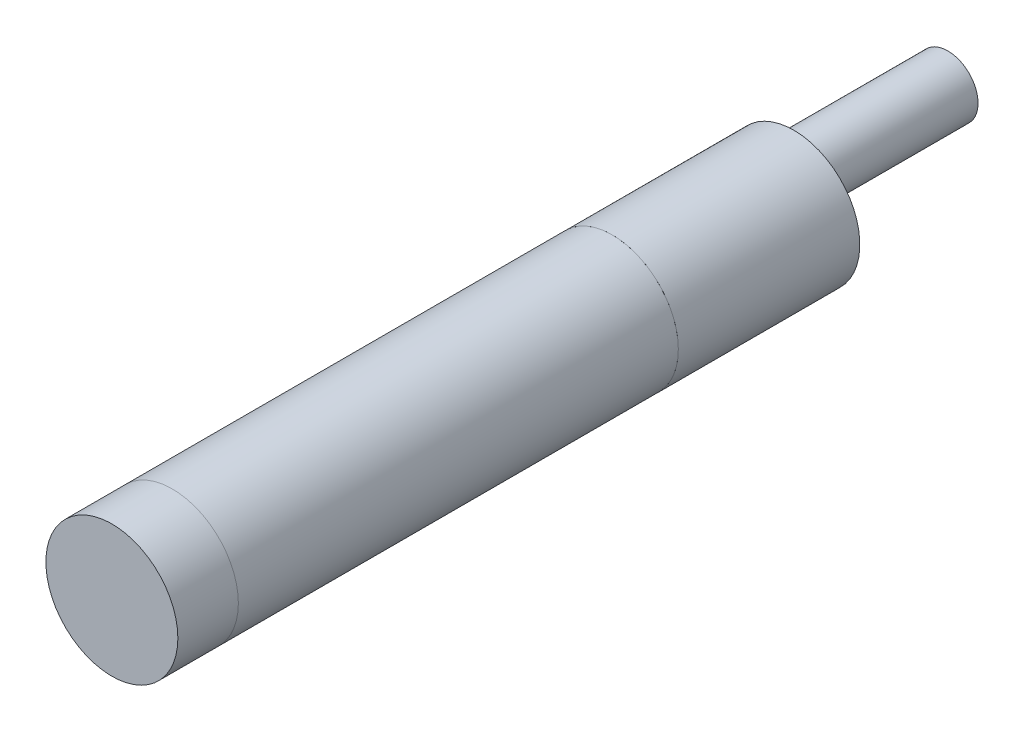
ISO-10303-21;
HEADER;
FILE_DESCRIPTION(('STEP AP214'),'2;1');
FILE_NAME('part.step','',(''),(''),'','','');
FILE_SCHEMA(('AUTOMOTIVE_DESIGN { 1 0 10303 214 1 1 1 1 }'));
ENDSEC;
DATA;
#1=APPLICATION_CONTEXT('core data for automotive mechanical design processes');
#2=APPLICATION_PROTOCOL_DEFINITION('international standard','automotive_design',2000,#1);
#3=PRODUCT_CONTEXT('',#1,'mechanical');
#4=PRODUCT('Part','Part','',(#3));
#5=PRODUCT_RELATED_PRODUCT_CATEGORY('part','',(#4));
#6=PRODUCT_DEFINITION_FORMATION('','',#4);
#7=PRODUCT_DEFINITION_CONTEXT('part definition',#1,'design');
#8=PRODUCT_DEFINITION('design','',#6,#7);
#9=PRODUCT_DEFINITION_SHAPE('','',#8);
#10=(LENGTH_UNIT() NAMED_UNIT(*) SI_UNIT(.MILLI.,.METRE.));
#11=(NAMED_UNIT(*) PLANE_ANGLE_UNIT() SI_UNIT($,.RADIAN.));
#12=(NAMED_UNIT(*) SI_UNIT($,.STERADIAN.) SOLID_ANGLE_UNIT());
#13=UNCERTAINTY_MEASURE_WITH_UNIT(LENGTH_MEASURE(1.E-05),#10,'distance_accuracy_value','');
#14=(GEOMETRIC_REPRESENTATION_CONTEXT(3) GLOBAL_UNCERTAINTY_ASSIGNED_CONTEXT((#13)) GLOBAL_UNIT_ASSIGNED_CONTEXT((#10,
#11,#12)) REPRESENTATION_CONTEXT('',''));
#15=CARTESIAN_POINT('',(0.,0.,0.));
#16=DIRECTION('',(0.,0.,1.));
#17=DIRECTION('',(1.,0.,0.));
#18=AXIS2_PLACEMENT_3D('',#15,#16,#17);
#19=CARTESIAN_POINT('',(0.,0.,-16.5));
#20=DIRECTION('',(0.,0.,1.));
#21=DIRECTION('',(1.,0.,0.));
#22=AXIS2_PLACEMENT_3D('',#19,#20,#21);
#23=CYLINDRICAL_SURFACE('',#22,6.);
#24=CARTESIAN_POINT('',(0.,0.,-16.5));
#25=DIRECTION('',(0.,0.,-1.));
#26=DIRECTION('',(-1.,0.,0.));
#27=AXIS2_PLACEMENT_3D('',#24,#25,#26);
#28=CIRCLE('',#27,6.);
#29=CARTESIAN_POINT('',(-6.,0.,-16.5));
#30=VERTEX_POINT('',#29);
#31=EDGE_CURVE('E11',#30,#30,#28,.T.);
#32=ORIENTED_EDGE('',*,*,#31,.F.);
#33=EDGE_LOOP('',(#32));
#34=FACE_BOUND('',#33,.T.);
#35=CARTESIAN_POINT('',(0.,0.,0.));
#36=DIRECTION('',(0.,0.,-1.));
#37=DIRECTION('',(-1.,0.,0.));
#38=AXIS2_PLACEMENT_3D('',#35,#36,#37);
#39=CIRCLE('',#38,6.);
#40=CARTESIAN_POINT('',(-6.,0.,0.));
#41=VERTEX_POINT('',#40);
#42=EDGE_CURVE('E44',#41,#41,#39,.T.);
#43=ORIENTED_EDGE('',*,*,#42,.T.);
#44=EDGE_LOOP('',(#43));
#45=FACE_BOUND('',#44,.T.);
#46=ADVANCED_FACE('F41',(#34,#45),#23,.T.);
#47=CARTESIAN_POINT('',(0.,0.,-16.5));
#48=DIRECTION('',(0.,0.,-1.));
#49=DIRECTION('',(-1.,0.,0.));
#50=AXIS2_PLACEMENT_3D('',#47,#48,#49);
#51=PLANE('',#50);
#52=CARTESIAN_POINT('',(0.,2.49332773336874,-16.5));
#53=DIRECTION('',(0.,0.,-1.));
#54=DIRECTION('',(-1.,0.,0.));
#55=AXIS2_PLACEMENT_3D('',#52,#53,#54);
#56=CIRCLE('',#55,2.75);
#57=CARTESIAN_POINT('',(-2.75,2.49332773336874,-16.5));
#58=VERTEX_POINT('',#57);
#59=EDGE_CURVE('E53',#58,#58,#56,.T.);
#60=ORIENTED_EDGE('',*,*,#59,.F.);
#61=EDGE_LOOP('',(#60));
#62=FACE_BOUND('',#61,.T.);
#63=ORIENTED_EDGE('',*,*,#31,.T.);
#64=EDGE_LOOP('',(#63));
#65=FACE_BOUND('',#64,.T.);
#66=ADVANCED_FACE('F68',(#62,#65),#51,.T.);
#67=CARTESIAN_POINT('',(0.,0.,0.));
#68=DIRECTION('',(0.,0.,-1.));
#69=DIRECTION('',(-1.,0.,0.));
#70=AXIS2_PLACEMENT_3D('',#67,#68,#69);
#71=PLANE('',#70);
#72=ORIENTED_EDGE('',*,*,#42,.F.);
#73=EDGE_LOOP('',(#72));
#74=FACE_BOUND('',#73,.T.);
#75=ADVANCED_FACE('F64',(#74),#71,.F.);
#76=CARTESIAN_POINT('',(0.,2.49332773336874,-30.5));
#77=DIRECTION('',(0.,0.,1.));
#78=DIRECTION('',(1.,0.,0.));
#79=AXIS2_PLACEMENT_3D('',#76,#77,#78);
#80=CYLINDRICAL_SURFACE('',#79,2.75);
#81=CARTESIAN_POINT('',(0.,2.49332773336874,-30.5));
#82=DIRECTION('',(0.,0.,-1.));
#83=DIRECTION('',(-1.,0.,0.));
#84=AXIS2_PLACEMENT_3D('',#81,#82,#83);
#85=CIRCLE('',#84,2.75);
#86=CARTESIAN_POINT('',(-2.75,2.49332773336874,-30.5));
#87=VERTEX_POINT('',#86);
#88=EDGE_CURVE('E51',#87,#87,#85,.T.);
#89=ORIENTED_EDGE('',*,*,#88,.F.);
#90=EDGE_LOOP('',(#89));
#91=FACE_BOUND('',#90,.T.);
#92=ORIENTED_EDGE('',*,*,#59,.T.);
#93=EDGE_LOOP('',(#92));
#94=FACE_BOUND('',#93,.T.);
#95=ADVANCED_FACE('F61',(#91,#94),#80,.T.);
#96=CARTESIAN_POINT('',(0.,2.49332773336874,-30.5));
#97=DIRECTION('',(0.,0.,-1.));
#98=DIRECTION('',(-1.,0.,0.));
#99=AXIS2_PLACEMENT_3D('',#96,#97,#98);
#100=PLANE('',#99);
#101=ORIENTED_EDGE('',*,*,#88,.T.);
#102=EDGE_LOOP('',(#101));
#103=FACE_BOUND('',#102,.T.);
#104=ADVANCED_FACE('F59',(#103),#100,.T.);
#105=CLOSED_SHELL('',(#46,#66,#75,#95,#104));
#106=MANIFOLD_SOLID_BREP('B2',#105);
#107=CARTESIAN_POINT('',(0.,0.,45.5));
#108=DIRECTION('',(0.,0.,-1.));
#109=DIRECTION('',(-1.,0.,0.));
#110=AXIS2_PLACEMENT_3D('',#107,#108,#109);
#111=CYLINDRICAL_SURFACE('',#110,6.);
#112=CARTESIAN_POINT('',(0.,0.,45.5));
#113=DIRECTION('',(0.,0.,1.));
#114=DIRECTION('',(1.,0.,0.));
#115=AXIS2_PLACEMENT_3D('',#112,#113,#114);
#116=CIRCLE('',#115,6.);
#117=CARTESIAN_POINT('',(6.,0.,45.5));
#118=VERTEX_POINT('',#117);
#119=EDGE_CURVE('E40',#118,#118,#116,.T.);
#120=ORIENTED_EDGE('',*,*,#119,.F.);
#121=EDGE_LOOP('',(#120));
#122=FACE_BOUND('',#121,.T.);
#123=CARTESIAN_POINT('',(0.,0.,40.));
#124=DIRECTION('',(0.,0.,1.));
#125=DIRECTION('',(1.,0.,0.));
#126=AXIS2_PLACEMENT_3D('',#123,#124,#125);
#127=CIRCLE('',#126,6.);
#128=CARTESIAN_POINT('',(6.,0.,40.));
#129=VERTEX_POINT('',#128);
#130=EDGE_CURVE('E121',#129,#129,#127,.T.);
#131=ORIENTED_EDGE('',*,*,#130,.T.);
#132=EDGE_LOOP('',(#131));
#133=FACE_BOUND('',#132,.T.);
#134=ADVANCED_FACE('F118',(#122,#133),#111,.T.);
#135=CARTESIAN_POINT('',(0.,0.,45.5));
#136=DIRECTION('',(0.,0.,1.));
#137=DIRECTION('',(1.,0.,0.));
#138=AXIS2_PLACEMENT_3D('',#135,#136,#137);
#139=PLANE('',#138);
#140=ORIENTED_EDGE('',*,*,#119,.T.);
#141=EDGE_LOOP('',(#140));
#142=FACE_BOUND('',#141,.T.);
#143=ADVANCED_FACE('F133',(#142),#139,.T.);
#144=CARTESIAN_POINT('',(0.,0.,40.));
#145=DIRECTION('',(0.,0.,1.));
#146=DIRECTION('',(1.,0.,0.));
#147=AXIS2_PLACEMENT_3D('',#144,#145,#146);
#148=PLANE('',#147);
#149=ORIENTED_EDGE('',*,*,#130,.F.);
#150=EDGE_LOOP('',(#149));
#151=FACE_BOUND('',#150,.T.);
#152=ADVANCED_FACE('F131',(#151),#148,.F.);
#153=CLOSED_SHELL('',(#134,#143,#152));
#154=MANIFOLD_SOLID_BREP('B6',#153);
#155=CARTESIAN_POINT('',(0.,0.,40.));
#156=DIRECTION('',(0.,0.,-1.));
#157=DIRECTION('',(-1.,0.,0.));
#158=AXIS2_PLACEMENT_3D('',#155,#156,#157);
#159=CYLINDRICAL_SURFACE('',#158,6.);
#160=CARTESIAN_POINT('',(0.,0.,40.));
#161=DIRECTION('',(0.,0.,1.));
#162=DIRECTION('',(1.,0.,0.));
#163=AXIS2_PLACEMENT_3D('',#160,#161,#162);
#164=CIRCLE('',#163,6.);
#165=CARTESIAN_POINT('',(6.,0.,40.));
#166=VERTEX_POINT('',#165);
#167=EDGE_CURVE('E117',#166,#166,#164,.T.);
#168=ORIENTED_EDGE('',*,*,#167,.F.);
#169=EDGE_LOOP('',(#168));
#170=FACE_BOUND('',#169,.T.);
#171=CARTESIAN_POINT('',(0.,0.,0.));
#172=DIRECTION('',(0.,0.,1.));
#173=DIRECTION('',(1.,0.,0.));
#174=AXIS2_PLACEMENT_3D('',#171,#172,#173);
#175=CIRCLE('',#174,6.);
#176=CARTESIAN_POINT('',(6.,0.,0.));
#177=VERTEX_POINT('',#176);
#178=EDGE_CURVE('E161',#177,#177,#175,.T.);
#179=ORIENTED_EDGE('',*,*,#178,.T.);
#180=EDGE_LOOP('',(#179));
#181=FACE_BOUND('',#180,.T.);
#182=ADVANCED_FACE('F158',(#170,#181),#159,.T.);
#183=CARTESIAN_POINT('',(0.,0.,40.));
#184=DIRECTION('',(0.,0.,1.));
#185=DIRECTION('',(1.,0.,0.));
#186=AXIS2_PLACEMENT_3D('',#183,#184,#185);
#187=PLANE('',#186);
#188=ORIENTED_EDGE('',*,*,#167,.T.);
#189=EDGE_LOOP('',(#188));
#190=FACE_BOUND('',#189,.T.);
#191=ADVANCED_FACE('F173',(#190),#187,.T.);
#192=CARTESIAN_POINT('',(0.,0.,0.));
#193=DIRECTION('',(0.,0.,1.));
#194=DIRECTION('',(1.,0.,0.));
#195=AXIS2_PLACEMENT_3D('',#192,#193,#194);
#196=PLANE('',#195);
#197=ORIENTED_EDGE('',*,*,#178,.F.);
#198=EDGE_LOOP('',(#197));
#199=FACE_BOUND('',#198,.T.);
#200=ADVANCED_FACE('F171',(#199),#196,.F.);
#201=CLOSED_SHELL('',(#182,#191,#200));
#202=MANIFOLD_SOLID_BREP('B35',#201);
#203=ADVANCED_BREP_SHAPE_REPRESENTATION('',(#18,#106,#154,#202),#14);
#204=SHAPE_DEFINITION_REPRESENTATION(#9,#203);
ENDSEC;
END-ISO-10303-21;
